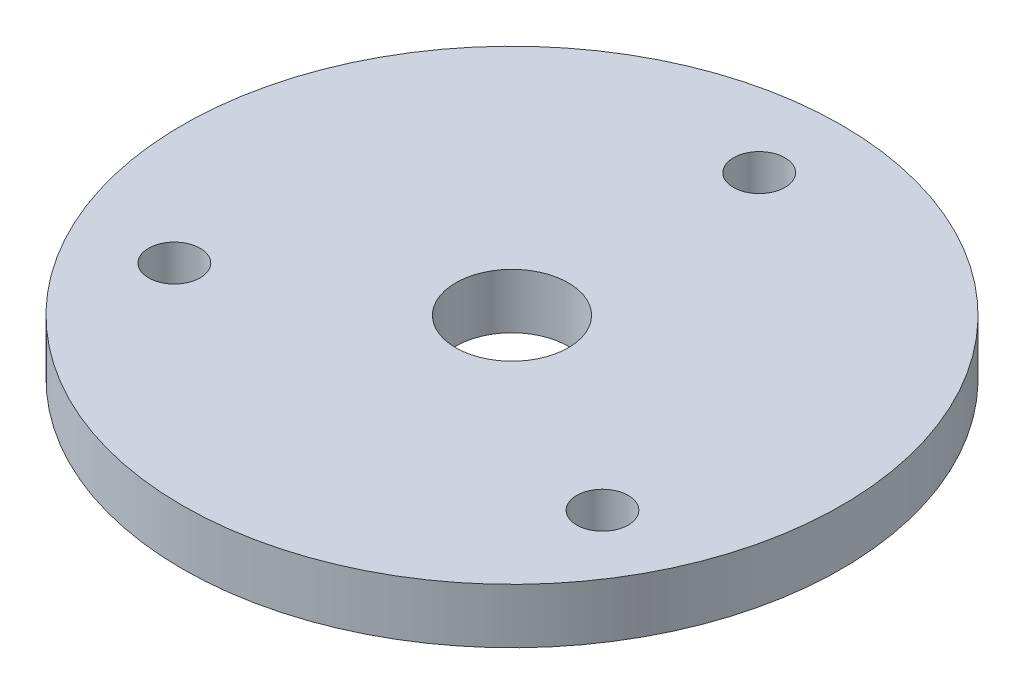
ISO-10303-21;
HEADER;
FILE_DESCRIPTION(('STEP AP214'),'2;1');
FILE_NAME('part.step','',(''),(''),'','','');
FILE_SCHEMA(('AUTOMOTIVE_DESIGN { 1 0 10303 214 1 1 1 1 }'));
ENDSEC;
DATA;
#1=APPLICATION_CONTEXT('core data for automotive mechanical design processes');
#2=APPLICATION_PROTOCOL_DEFINITION('international standard','automotive_design',2000,#1);
#3=PRODUCT_CONTEXT('',#1,'mechanical');
#4=PRODUCT('Part','Part','',(#3));
#5=PRODUCT_RELATED_PRODUCT_CATEGORY('part','',(#4));
#6=PRODUCT_DEFINITION_FORMATION('','',#4);
#7=PRODUCT_DEFINITION_CONTEXT('part definition',#1,'design');
#8=PRODUCT_DEFINITION('design','',#6,#7);
#9=PRODUCT_DEFINITION_SHAPE('','',#8);
#10=(LENGTH_UNIT() NAMED_UNIT(*) SI_UNIT(.MILLI.,.METRE.));
#11=(NAMED_UNIT(*) PLANE_ANGLE_UNIT() SI_UNIT($,.RADIAN.));
#12=(NAMED_UNIT(*) SI_UNIT($,.STERADIAN.) SOLID_ANGLE_UNIT());
#13=UNCERTAINTY_MEASURE_WITH_UNIT(LENGTH_MEASURE(1.E-05),#10,'distance_accuracy_value','');
#14=(GEOMETRIC_REPRESENTATION_CONTEXT(3) GLOBAL_UNCERTAINTY_ASSIGNED_CONTEXT((#13)) GLOBAL_UNIT_ASSIGNED_CONTEXT((#10,
#11,#12)) REPRESENTATION_CONTEXT('',''));
#15=CARTESIAN_POINT('',(0.,0.,0.));
#16=DIRECTION('',(0.,0.,1.));
#17=DIRECTION('',(1.,0.,0.));
#18=AXIS2_PLACEMENT_3D('',#15,#16,#17);
#19=CARTESIAN_POINT('',(0.,6.35,0.));
#20=DIRECTION('',(0.,-1.,0.));
#21=DIRECTION('',(0.,0.,-1.));
#22=AXIS2_PLACEMENT_3D('',#19,#20,#21);
#23=CYLINDRICAL_SURFACE('',#22,76.2);
#24=CARTESIAN_POINT('',(0.,6.35,0.));
#25=DIRECTION('',(0.,1.,0.));
#26=DIRECTION('',(0.,0.,1.));
#27=AXIS2_PLACEMENT_3D('',#24,#25,#26);
#28=CIRCLE('',#27,76.2);
#29=CARTESIAN_POINT('',(0.,6.35,76.2));
#30=VERTEX_POINT('',#29);
#31=EDGE_CURVE('E10',#30,#30,#28,.T.);
#32=ORIENTED_EDGE('',*,*,#31,.F.);
#33=EDGE_LOOP('',(#32));
#34=FACE_BOUND('',#33,.T.);
#35=CARTESIAN_POINT('',(0.,-6.35,0.));
#36=DIRECTION('',(0.,1.,0.));
#37=DIRECTION('',(0.,0.,1.));
#38=AXIS2_PLACEMENT_3D('',#35,#36,#37);
#39=CIRCLE('',#38,76.2);
#40=CARTESIAN_POINT('',(0.,-6.35,76.2));
#41=VERTEX_POINT('',#40);
#42=EDGE_CURVE('E46',#41,#41,#39,.T.);
#43=ORIENTED_EDGE('',*,*,#42,.T.);
#44=EDGE_LOOP('',(#43));
#45=FACE_BOUND('',#44,.T.);
#46=ADVANCED_FACE('F40',(#34,#45),#23,.T.);
#47=CARTESIAN_POINT('',(0.,6.35,0.));
#48=DIRECTION('',(0.,1.,0.));
#49=DIRECTION('',(0.,0.,1.));
#50=AXIS2_PLACEMENT_3D('',#47,#48,#49);
#51=PLANE('',#50);
#52=CARTESIAN_POINT('',(-49.4933518262807,6.35,28.575));
#53=DIRECTION('',(0.,1.,0.));
#54=DIRECTION('',(0.,0.,1.));
#55=AXIS2_PLACEMENT_3D('',#52,#53,#54);
#56=CIRCLE('',#55,5.953125);
#57=CARTESIAN_POINT('',(-49.4933518262807,6.35,34.528125));
#58=VERTEX_POINT('',#57);
#59=EDGE_CURVE('E63',#58,#58,#56,.T.);
#60=ORIENTED_EDGE('',*,*,#59,.F.);
#61=EDGE_LOOP('',(#60));
#62=FACE_BOUND('',#61,.T.);
#63=CARTESIAN_POINT('',(49.4933518262807,6.35,28.575));
#64=DIRECTION('',(0.,1.,0.));
#65=DIRECTION('',(0.,0.,1.));
#66=AXIS2_PLACEMENT_3D('',#63,#64,#65);
#67=CIRCLE('',#66,5.95312500000001);
#68=CARTESIAN_POINT('',(49.4933518262807,6.35,34.528125));
#69=VERTEX_POINT('',#68);
#70=EDGE_CURVE('E69',#69,#69,#67,.T.);
#71=ORIENTED_EDGE('',*,*,#70,.F.);
#72=EDGE_LOOP('',(#71));
#73=FACE_BOUND('',#72,.T.);
#74=CARTESIAN_POINT('',(0.,6.35,-57.15));
#75=DIRECTION('',(0.,1.,0.));
#76=DIRECTION('',(0.,0.,1.));
#77=AXIS2_PLACEMENT_3D('',#74,#75,#76);
#78=CIRCLE('',#77,5.953125);
#79=CARTESIAN_POINT('',(0.,6.35,-51.196875));
#80=VERTEX_POINT('',#79);
#81=EDGE_CURVE('E58',#80,#80,#78,.T.);
#82=ORIENTED_EDGE('',*,*,#81,.F.);
#83=EDGE_LOOP('',(#82));
#84=FACE_BOUND('',#83,.T.);
#85=CARTESIAN_POINT('',(0.,6.35,0.));
#86=DIRECTION('',(0.,1.,0.));
#87=DIRECTION('',(0.,0.,1.));
#88=AXIS2_PLACEMENT_3D('',#85,#86,#87);
#89=CIRCLE('',#88,13.0175);
#90=CARTESIAN_POINT('',(0.,6.35,13.0175));
#91=VERTEX_POINT('',#90);
#92=EDGE_CURVE('E54',#91,#91,#89,.T.);
#93=ORIENTED_EDGE('',*,*,#92,.F.);
#94=EDGE_LOOP('',(#93));
#95=FACE_BOUND('',#94,.T.);
#96=ORIENTED_EDGE('',*,*,#31,.T.);
#97=EDGE_LOOP('',(#96));
#98=FACE_BOUND('',#97,.T.);
#99=ADVANCED_FACE('F80',(#62,#73,#84,#95,#98),#51,.T.);
#100=CARTESIAN_POINT('',(0.,-6.35,0.));
#101=DIRECTION('',(0.,1.,0.));
#102=DIRECTION('',(0.,0.,1.));
#103=AXIS2_PLACEMENT_3D('',#100,#101,#102);
#104=PLANE('',#103);
#105=CARTESIAN_POINT('',(-49.4933518262807,-6.35,28.575));
#106=DIRECTION('',(0.,1.,0.));
#107=DIRECTION('',(0.,0.,1.));
#108=AXIS2_PLACEMENT_3D('',#105,#106,#107);
#109=CIRCLE('',#108,5.953125);
#110=CARTESIAN_POINT('',(-49.4933518262807,-6.35,34.528125));
#111=VERTEX_POINT('',#110);
#112=EDGE_CURVE('E60',#111,#111,#109,.T.);
#113=ORIENTED_EDGE('',*,*,#112,.T.);
#114=EDGE_LOOP('',(#113));
#115=FACE_BOUND('',#114,.T.);
#116=CARTESIAN_POINT('',(49.4933518262807,-6.35,28.575));
#117=DIRECTION('',(0.,1.,0.));
#118=DIRECTION('',(0.,0.,1.));
#119=AXIS2_PLACEMENT_3D('',#116,#117,#118);
#120=CIRCLE('',#119,5.95312500000001);
#121=CARTESIAN_POINT('',(49.4933518262807,-6.35,34.528125));
#122=VERTEX_POINT('',#121);
#123=EDGE_CURVE('E66',#122,#122,#120,.T.);
#124=ORIENTED_EDGE('',*,*,#123,.T.);
#125=EDGE_LOOP('',(#124));
#126=FACE_BOUND('',#125,.T.);
#127=CARTESIAN_POINT('',(0.,-6.35,-57.15));
#128=DIRECTION('',(0.,1.,0.));
#129=DIRECTION('',(0.,0.,1.));
#130=AXIS2_PLACEMENT_3D('',#127,#128,#129);
#131=CIRCLE('',#130,5.953125);
#132=CARTESIAN_POINT('',(0.,-6.35,-51.196875));
#133=VERTEX_POINT('',#132);
#134=EDGE_CURVE('E72',#133,#133,#131,.T.);
#135=ORIENTED_EDGE('',*,*,#134,.T.);
#136=EDGE_LOOP('',(#135));
#137=FACE_BOUND('',#136,.T.);
#138=CARTESIAN_POINT('',(0.,-6.35,0.));
#139=DIRECTION('',(0.,1.,0.));
#140=DIRECTION('',(0.,0.,1.));
#141=AXIS2_PLACEMENT_3D('',#138,#139,#140);
#142=CIRCLE('',#141,13.0175);
#143=CARTESIAN_POINT('',(0.,-6.35,13.0175));
#144=VERTEX_POINT('',#143);
#145=EDGE_CURVE('E50',#144,#144,#142,.T.);
#146=ORIENTED_EDGE('',*,*,#145,.T.);
#147=EDGE_LOOP('',(#146));
#148=FACE_BOUND('',#147,.T.);
#149=ORIENTED_EDGE('',*,*,#42,.F.);
#150=EDGE_LOOP('',(#149));
#151=FACE_BOUND('',#150,.T.);
#152=ADVANCED_FACE('F83',(#115,#126,#137,#148,#151),#104,.F.);
#153=CARTESIAN_POINT('',(0.,-6.35,0.));
#154=DIRECTION('',(0.,1.,0.));
#155=DIRECTION('',(0.,0.,1.));
#156=AXIS2_PLACEMENT_3D('',#153,#154,#155);
#157=CYLINDRICAL_SURFACE('',#156,13.0175);
#158=ORIENTED_EDGE('',*,*,#145,.F.);
#159=EDGE_LOOP('',(#158));
#160=FACE_BOUND('',#159,.T.);
#161=ORIENTED_EDGE('',*,*,#92,.T.);
#162=EDGE_LOOP('',(#161));
#163=FACE_BOUND('',#162,.T.);
#164=ADVANCED_FACE('F87',(#160,#163),#157,.F.);
#165=CARTESIAN_POINT('',(0.,-6.35,-57.15));
#166=DIRECTION('',(0.,1.,0.));
#167=DIRECTION('',(0.,0.,1.));
#168=AXIS2_PLACEMENT_3D('',#165,#166,#167);
#169=CYLINDRICAL_SURFACE('',#168,5.953125);
#170=ORIENTED_EDGE('',*,*,#134,.F.);
#171=EDGE_LOOP('',(#170));
#172=FACE_BOUND('',#171,.T.);
#173=ORIENTED_EDGE('',*,*,#81,.T.);
#174=EDGE_LOOP('',(#173));
#175=FACE_BOUND('',#174,.T.);
#176=ADVANCED_FACE('F78',(#172,#175),#169,.F.);
#177=CARTESIAN_POINT('',(49.4933518262807,-6.35,28.575));
#178=DIRECTION('',(0.,1.,0.));
#179=DIRECTION('',(0.,0.,1.));
#180=AXIS2_PLACEMENT_3D('',#177,#178,#179);
#181=CYLINDRICAL_SURFACE('',#180,5.95312500000001);
#182=ORIENTED_EDGE('',*,*,#123,.F.);
#183=EDGE_LOOP('',(#182));
#184=FACE_BOUND('',#183,.T.);
#185=ORIENTED_EDGE('',*,*,#70,.T.);
#186=EDGE_LOOP('',(#185));
#187=FACE_BOUND('',#186,.T.);
#188=ADVANCED_FACE('F95',(#184,#187),#181,.F.);
#189=CARTESIAN_POINT('',(-49.4933518262807,-6.35,28.575));
#190=DIRECTION('',(0.,1.,0.));
#191=DIRECTION('',(0.,0.,1.));
#192=AXIS2_PLACEMENT_3D('',#189,#190,#191);
#193=CYLINDRICAL_SURFACE('',#192,5.953125);
#194=ORIENTED_EDGE('',*,*,#112,.F.);
#195=EDGE_LOOP('',(#194));
#196=FACE_BOUND('',#195,.T.);
#197=ORIENTED_EDGE('',*,*,#59,.T.);
#198=EDGE_LOOP('',(#197));
#199=FACE_BOUND('',#198,.T.);
#200=ADVANCED_FACE('F135',(#196,#199),#193,.F.);
#201=CLOSED_SHELL('',(#46,#99,#152,#164,#176,#188,#200));
#202=MANIFOLD_SOLID_BREP('B2',#201);
#203=ADVANCED_BREP_SHAPE_REPRESENTATION('',(#18,#202),#14);
#204=SHAPE_DEFINITION_REPRESENTATION(#9,#203);
ENDSEC;
END-ISO-10303-21;
